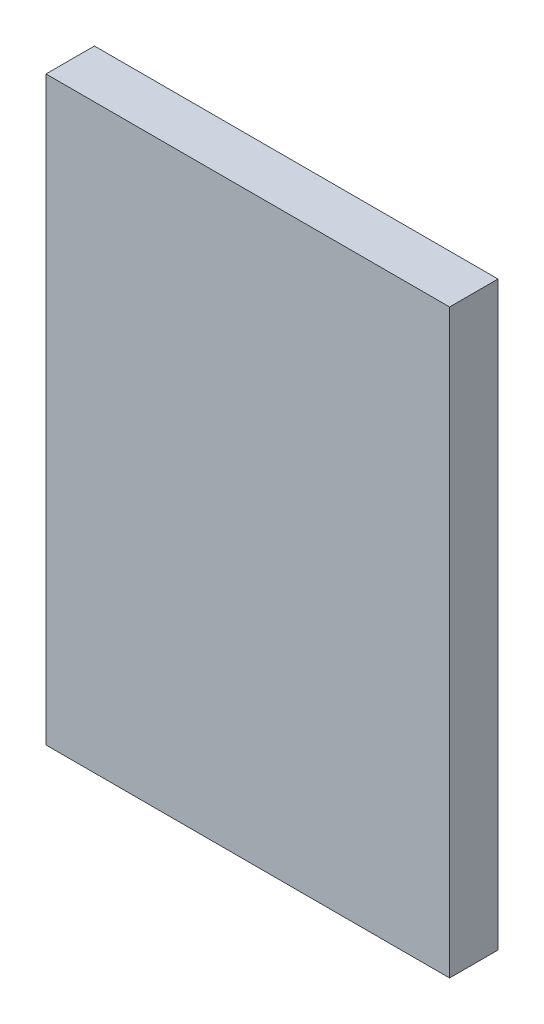
ISO-10303-21;
HEADER;
FILE_DESCRIPTION(('STEP AP214'),'2;1');
FILE_NAME('part.step','',(''),(''),'','','');
FILE_SCHEMA(('AUTOMOTIVE_DESIGN { 1 0 10303 214 1 1 1 1 }'));
ENDSEC;
DATA;
#1=APPLICATION_CONTEXT('core data for automotive mechanical design processes');
#2=APPLICATION_PROTOCOL_DEFINITION('international standard','automotive_design',2000,#1);
#3=PRODUCT_CONTEXT('',#1,'mechanical');
#4=PRODUCT('Part','Part','',(#3));
#5=PRODUCT_RELATED_PRODUCT_CATEGORY('part','',(#4));
#6=PRODUCT_DEFINITION_FORMATION('','',#4);
#7=PRODUCT_DEFINITION_CONTEXT('part definition',#1,'design');
#8=PRODUCT_DEFINITION('design','',#6,#7);
#9=PRODUCT_DEFINITION_SHAPE('','',#8);
#10=(LENGTH_UNIT() NAMED_UNIT(*) SI_UNIT(.MILLI.,.METRE.));
#11=(NAMED_UNIT(*) PLANE_ANGLE_UNIT() SI_UNIT($,.RADIAN.));
#12=(NAMED_UNIT(*) SI_UNIT($,.STERADIAN.) SOLID_ANGLE_UNIT());
#13=UNCERTAINTY_MEASURE_WITH_UNIT(LENGTH_MEASURE(1.E-05),#10,'distance_accuracy_value','');
#14=(GEOMETRIC_REPRESENTATION_CONTEXT(3) GLOBAL_UNCERTAINTY_ASSIGNED_CONTEXT((#13)) GLOBAL_UNIT_ASSIGNED_CONTEXT((#10,
#11,#12)) REPRESENTATION_CONTEXT('',''));
#15=CARTESIAN_POINT('',(0.,0.,0.));
#16=DIRECTION('',(0.,0.,1.));
#17=DIRECTION('',(1.,0.,0.));
#18=AXIS2_PLACEMENT_3D('',#15,#16,#17);
#19=CARTESIAN_POINT('',(-6.35162601626016,7.52032520325202,3.));
#20=DIRECTION('',(1.,0.,0.));
#21=DIRECTION('',(0.,1.,0.));
#22=AXIS2_PLACEMENT_3D('',#19,#20,#21);
#23=PLANE('',#22);
#24=DIRECTION('',(0.,-1.,0.));
#25=VECTOR('',#24,1.);
#26=CARTESIAN_POINT('',(-6.35162601626016,7.52032520325202,0.));
#27=LINE('',#26,#25);
#28=CARTESIAN_POINT('',(-6.35162601626016,7.52032520325202,0.));
#29=VERTEX_POINT('',#28);
#30=CARTESIAN_POINT('',(-6.35162601626016,-28.479674796748,0.));
#31=VERTEX_POINT('',#30);
#32=EDGE_CURVE('E107',#29,#31,#27,.T.);
#33=ORIENTED_EDGE('',*,*,#32,.T.);
#34=DIRECTION('',(0.,0.,-1.));
#35=VECTOR('',#34,1.);
#36=CARTESIAN_POINT('',(-6.35162601626016,-28.479674796748,3.));
#37=LINE('',#36,#35);
#38=CARTESIAN_POINT('',(-6.35162601626016,-28.479674796748,3.));
#39=VERTEX_POINT('',#38);
#40=EDGE_CURVE('E11',#39,#31,#37,.T.);
#41=ORIENTED_EDGE('',*,*,#40,.F.);
#42=DIRECTION('',(0.,-1.,0.));
#43=VECTOR('',#42,1.);
#44=CARTESIAN_POINT('',(-6.35162601626016,7.52032520325202,3.));
#45=LINE('',#44,#43);
#46=CARTESIAN_POINT('',(-6.35162601626016,7.52032520325202,3.));
#47=VERTEX_POINT('',#46);
#48=EDGE_CURVE('E91',#47,#39,#45,.T.);
#49=ORIENTED_EDGE('',*,*,#48,.F.);
#50=DIRECTION('',(0.,0.,-1.));
#51=VECTOR('',#50,1.);
#52=CARTESIAN_POINT('',(-6.35162601626016,7.52032520325202,3.));
#53=LINE('',#52,#51);
#54=EDGE_CURVE('E103',#47,#29,#53,.T.);
#55=ORIENTED_EDGE('',*,*,#54,.T.);
#56=EDGE_LOOP('',(#33,#41,#49,#55));
#57=FACE_BOUND('',#56,.T.);
#58=ADVANCED_FACE('F39',(#57),#23,.F.);
#59=CARTESIAN_POINT('',(-6.35162601626016,-28.479674796748,3.));
#60=DIRECTION('',(0.,1.,0.));
#61=DIRECTION('',(0.,0.,1.));
#62=AXIS2_PLACEMENT_3D('',#59,#60,#61);
#63=PLANE('',#62);
#64=DIRECTION('',(1.,0.,0.));
#65=VECTOR('',#64,1.);
#66=CARTESIAN_POINT('',(-6.35162601626016,-28.479674796748,0.));
#67=LINE('',#66,#65);
#68=CARTESIAN_POINT('',(18.6483739837398,-28.479674796748,0.));
#69=VERTEX_POINT('',#68);
#70=EDGE_CURVE('E96',#31,#69,#67,.T.);
#71=ORIENTED_EDGE('',*,*,#70,.T.);
#72=DIRECTION('',(0.,0.,-1.));
#73=VECTOR('',#72,1.);
#74=CARTESIAN_POINT('',(18.6483739837398,-28.479674796748,3.));
#75=LINE('',#74,#73);
#76=CARTESIAN_POINT('',(18.6483739837398,-28.479674796748,3.));
#77=VERTEX_POINT('',#76);
#78=EDGE_CURVE('E48',#77,#69,#75,.T.);
#79=ORIENTED_EDGE('',*,*,#78,.F.);
#80=DIRECTION('',(1.,0.,0.));
#81=VECTOR('',#80,1.);
#82=CARTESIAN_POINT('',(-6.35162601626016,-28.479674796748,3.));
#83=LINE('',#82,#81);
#84=EDGE_CURVE('E86',#39,#77,#83,.T.);
#85=ORIENTED_EDGE('',*,*,#84,.F.);
#86=ORIENTED_EDGE('',*,*,#40,.T.);
#87=EDGE_LOOP('',(#71,#79,#85,#86));
#88=FACE_BOUND('',#87,.T.);
#89=ADVANCED_FACE('F95',(#88),#63,.F.);
#90=CARTESIAN_POINT('',(18.6483739837398,7.52032520325202,3.));
#91=DIRECTION('',(-1.,0.,0.));
#92=DIRECTION('',(0.,-1.,0.));
#93=AXIS2_PLACEMENT_3D('',#90,#91,#92);
#94=PLANE('',#93);
#95=DIRECTION('',(0.,1.,0.));
#96=VECTOR('',#95,1.);
#97=CARTESIAN_POINT('',(18.6483739837398,7.52032520325202,0.));
#98=LINE('',#97,#96);
#99=CARTESIAN_POINT('',(18.6483739837398,7.52032520325202,0.));
#100=VERTEX_POINT('',#99);
#101=EDGE_CURVE('E73',#69,#100,#98,.T.);
#102=ORIENTED_EDGE('',*,*,#101,.T.);
#103=DIRECTION('',(0.,0.,-1.));
#104=VECTOR('',#103,1.);
#105=CARTESIAN_POINT('',(18.6483739837398,7.52032520325202,3.));
#106=LINE('',#105,#104);
#107=CARTESIAN_POINT('',(18.6483739837398,7.52032520325202,3.));
#108=VERTEX_POINT('',#107);
#109=EDGE_CURVE('E98',#108,#100,#106,.T.);
#110=ORIENTED_EDGE('',*,*,#109,.F.);
#111=DIRECTION('',(0.,1.,0.));
#112=VECTOR('',#111,1.);
#113=CARTESIAN_POINT('',(18.6483739837398,7.52032520325202,3.));
#114=LINE('',#113,#112);
#115=EDGE_CURVE('E89',#77,#108,#114,.T.);
#116=ORIENTED_EDGE('',*,*,#115,.F.);
#117=ORIENTED_EDGE('',*,*,#78,.T.);
#118=EDGE_LOOP('',(#102,#110,#116,#117));
#119=FACE_BOUND('',#118,.T.);
#120=ADVANCED_FACE('F99',(#119),#94,.F.);
#121=CARTESIAN_POINT('',(-6.35162601626016,7.52032520325202,3.));
#122=DIRECTION('',(0.,-1.,0.));
#123=DIRECTION('',(0.,0.,-1.));
#124=AXIS2_PLACEMENT_3D('',#121,#122,#123);
#125=PLANE('',#124);
#126=DIRECTION('',(-1.,0.,0.));
#127=VECTOR('',#126,1.);
#128=CARTESIAN_POINT('',(-6.35162601626016,7.52032520325202,0.));
#129=LINE('',#128,#127);
#130=EDGE_CURVE('E79',#100,#29,#129,.T.);
#131=ORIENTED_EDGE('',*,*,#130,.T.);
#132=ORIENTED_EDGE('',*,*,#54,.F.);
#133=DIRECTION('',(-1.,0.,0.));
#134=VECTOR('',#133,1.);
#135=CARTESIAN_POINT('',(-6.35162601626016,7.52032520325202,3.));
#136=LINE('',#135,#134);
#137=EDGE_CURVE('E56',#108,#47,#136,.T.);
#138=ORIENTED_EDGE('',*,*,#137,.F.);
#139=ORIENTED_EDGE('',*,*,#109,.T.);
#140=EDGE_LOOP('',(#131,#132,#138,#139));
#141=FACE_BOUND('',#140,.T.);
#142=ADVANCED_FACE('F120',(#141),#125,.F.);
#143=CARTESIAN_POINT('',(0.,0.,3.));
#144=DIRECTION('',(0.,0.,1.));
#145=DIRECTION('',(1.,0.,0.));
#146=AXIS2_PLACEMENT_3D('',#143,#144,#145);
#147=PLANE('',#146);
#148=ORIENTED_EDGE('',*,*,#48,.T.);
#149=ORIENTED_EDGE('',*,*,#84,.T.);
#150=ORIENTED_EDGE('',*,*,#115,.T.);
#151=ORIENTED_EDGE('',*,*,#137,.T.);
#152=EDGE_LOOP('',(#148,#149,#150,#151));
#153=FACE_BOUND('',#152,.T.);
#154=ADVANCED_FACE('F87',(#153),#147,.T.);
#155=CARTESIAN_POINT('',(0.,0.,0.));
#156=DIRECTION('',(0.,0.,1.));
#157=DIRECTION('',(1.,0.,0.));
#158=AXIS2_PLACEMENT_3D('',#155,#156,#157);
#159=PLANE('',#158);
#160=ORIENTED_EDGE('',*,*,#32,.F.);
#161=ORIENTED_EDGE('',*,*,#130,.F.);
#162=ORIENTED_EDGE('',*,*,#101,.F.);
#163=ORIENTED_EDGE('',*,*,#70,.F.);
#164=EDGE_LOOP('',(#160,#161,#162,#163));
#165=FACE_BOUND('',#164,.T.);
#166=ADVANCED_FACE('F123',(#165),#159,.F.);
#167=CLOSED_SHELL('',(#58,#89,#120,#142,#154,#166));
#168=MANIFOLD_SOLID_BREP('B2',#167);
#169=ADVANCED_BREP_SHAPE_REPRESENTATION('',(#18,#168),#14);
#170=SHAPE_DEFINITION_REPRESENTATION(#9,#169);
ENDSEC;
END-ISO-10303-21;
